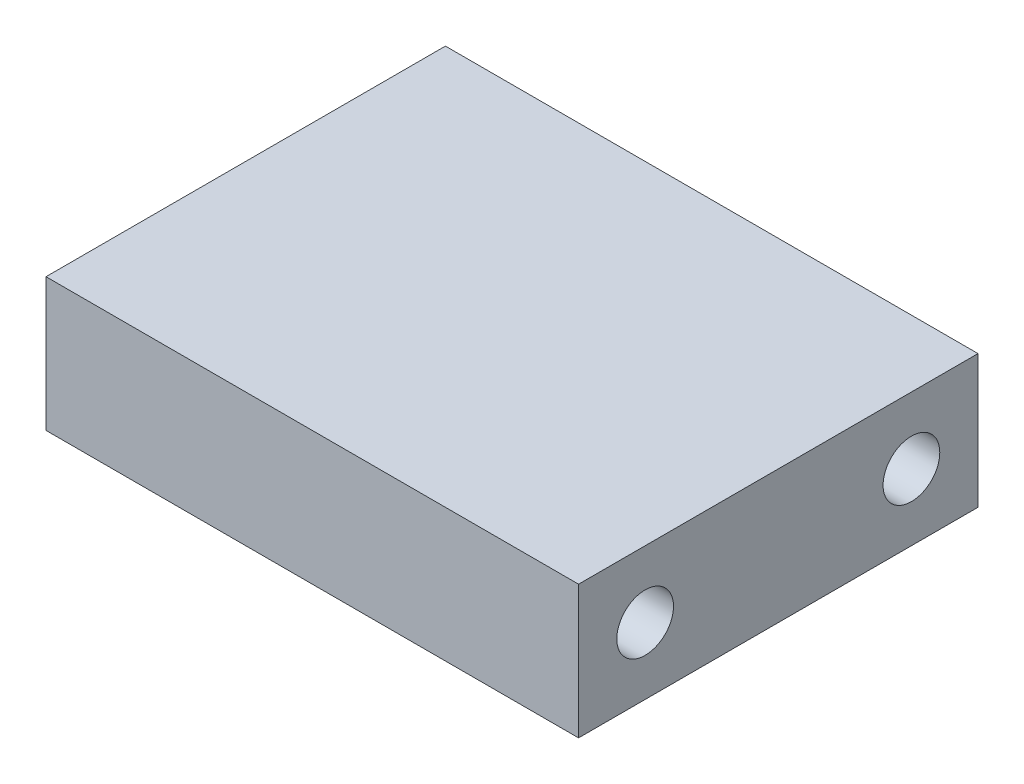
ISO-10303-21;
HEADER;
FILE_DESCRIPTION(('STEP AP214'),'2;1');
FILE_NAME('part.step','',(''),(''),'','','');
FILE_SCHEMA(('AUTOMOTIVE_DESIGN { 1 0 10303 214 1 1 1 1 }'));
ENDSEC;
DATA;
#1=APPLICATION_CONTEXT('core data for automotive mechanical design processes');
#2=APPLICATION_PROTOCOL_DEFINITION('international standard','automotive_design',2000,#1);
#3=PRODUCT_CONTEXT('',#1,'mechanical');
#4=PRODUCT('Part','Part','',(#3));
#5=PRODUCT_RELATED_PRODUCT_CATEGORY('part','',(#4));
#6=PRODUCT_DEFINITION_FORMATION('','',#4);
#7=PRODUCT_DEFINITION_CONTEXT('part definition',#1,'design');
#8=PRODUCT_DEFINITION('design','',#6,#7);
#9=PRODUCT_DEFINITION_SHAPE('','',#8);
#10=(LENGTH_UNIT() NAMED_UNIT(*) SI_UNIT(.MILLI.,.METRE.));
#11=(NAMED_UNIT(*) PLANE_ANGLE_UNIT() SI_UNIT($,.RADIAN.));
#12=(NAMED_UNIT(*) SI_UNIT($,.STERADIAN.) SOLID_ANGLE_UNIT());
#13=UNCERTAINTY_MEASURE_WITH_UNIT(LENGTH_MEASURE(1.E-05),#10,'distance_accuracy_value','');
#14=(GEOMETRIC_REPRESENTATION_CONTEXT(3) GLOBAL_UNCERTAINTY_ASSIGNED_CONTEXT((#13)) GLOBAL_UNIT_ASSIGNED_CONTEXT((#10,
#11,#12)) REPRESENTATION_CONTEXT('',''));
#15=CARTESIAN_POINT('',(0.,0.,0.));
#16=DIRECTION('',(0.,0.,1.));
#17=DIRECTION('',(1.,0.,0.));
#18=AXIS2_PLACEMENT_3D('',#15,#16,#17);
#19=CARTESIAN_POINT('',(-12.7,6.35,-9.525));
#20=DIRECTION('',(1.,0.,0.));
#21=DIRECTION('',(0.,0.,-1.));
#22=AXIS2_PLACEMENT_3D('',#19,#20,#21);
#23=PLANE('',#22);
#24=DIRECTION('',(0.,0.,1.));
#25=VECTOR('',#24,1.);
#26=CARTESIAN_POINT('',(-12.7,0.,-9.525));
#27=LINE('',#26,#25);
#28=CARTESIAN_POINT('',(-12.7,0.,-9.525));
#29=VERTEX_POINT('',#28);
#30=CARTESIAN_POINT('',(-12.7,0.,9.525));
#31=VERTEX_POINT('',#30);
#32=EDGE_CURVE('E98',#29,#31,#27,.T.);
#33=ORIENTED_EDGE('',*,*,#32,.T.);
#34=DIRECTION('',(0.,-1.,0.));
#35=VECTOR('',#34,1.);
#36=CARTESIAN_POINT('',(-12.7,6.35,9.525));
#37=LINE('',#36,#35);
#38=CARTESIAN_POINT('',(-12.7,6.35,9.525));
#39=VERTEX_POINT('',#38);
#40=EDGE_CURVE('E11',#39,#31,#37,.T.);
#41=ORIENTED_EDGE('',*,*,#40,.F.);
#42=DIRECTION('',(0.,0.,1.));
#43=VECTOR('',#42,1.);
#44=CARTESIAN_POINT('',(-12.7,6.35,-9.525));
#45=LINE('',#44,#43);
#46=CARTESIAN_POINT('',(-12.7,6.35,-9.525));
#47=VERTEX_POINT('',#46);
#48=EDGE_CURVE('E107',#47,#39,#45,.T.);
#49=ORIENTED_EDGE('',*,*,#48,.F.);
#50=DIRECTION('',(0.,-1.,0.));
#51=VECTOR('',#50,1.);
#52=CARTESIAN_POINT('',(-12.7,6.35,-9.525));
#53=LINE('',#52,#51);
#54=EDGE_CURVE('E113',#47,#29,#53,.T.);
#55=ORIENTED_EDGE('',*,*,#54,.T.);
#56=EDGE_LOOP('',(#33,#41,#49,#55));
#57=FACE_BOUND('',#56,.T.);
#58=ADVANCED_FACE('F34',(#57),#23,.F.);
#59=CARTESIAN_POINT('',(-12.7,6.35,9.525));
#60=DIRECTION('',(0.,0.,-1.));
#61=DIRECTION('',(-1.,0.,0.));
#62=AXIS2_PLACEMENT_3D('',#59,#60,#61);
#63=PLANE('',#62);
#64=DIRECTION('',(1.,0.,0.));
#65=VECTOR('',#64,1.);
#66=CARTESIAN_POINT('',(-12.7,0.,9.525));
#67=LINE('',#66,#65);
#68=CARTESIAN_POINT('',(12.7,0.,9.525));
#69=VERTEX_POINT('',#68);
#70=EDGE_CURVE('E101',#31,#69,#67,.T.);
#71=ORIENTED_EDGE('',*,*,#70,.T.);
#72=DIRECTION('',(0.,-1.,0.));
#73=VECTOR('',#72,1.);
#74=CARTESIAN_POINT('',(12.7,6.35,9.525));
#75=LINE('',#74,#73);
#76=CARTESIAN_POINT('',(12.7,6.35,9.525));
#77=VERTEX_POINT('',#76);
#78=EDGE_CURVE('E41',#77,#69,#75,.T.);
#79=ORIENTED_EDGE('',*,*,#78,.F.);
#80=DIRECTION('',(1.,0.,0.));
#81=VECTOR('',#80,1.);
#82=CARTESIAN_POINT('',(-12.7,6.35,9.525));
#83=LINE('',#82,#81);
#84=EDGE_CURVE('E109',#39,#77,#83,.T.);
#85=ORIENTED_EDGE('',*,*,#84,.F.);
#86=ORIENTED_EDGE('',*,*,#40,.T.);
#87=EDGE_LOOP('',(#71,#79,#85,#86));
#88=FACE_BOUND('',#87,.T.);
#89=ADVANCED_FACE('F134',(#88),#63,.F.);
#90=CARTESIAN_POINT('',(12.7,6.35,-9.525));
#91=DIRECTION('',(-1.,0.,0.));
#92=DIRECTION('',(0.,0.,1.));
#93=AXIS2_PLACEMENT_3D('',#90,#91,#92);
#94=PLANE('',#93);
#95=CARTESIAN_POINT('',(12.7,3.175,6.35));
#96=DIRECTION('',(1.,0.,0.));
#97=DIRECTION('',(0.,0.,-1.));
#98=AXIS2_PLACEMENT_3D('',#95,#96,#97);
#99=CIRCLE('',#98,1.35255);
#100=CARTESIAN_POINT('',(12.7,3.175,4.99745));
#101=VERTEX_POINT('',#100);
#102=EDGE_CURVE('E87',#101,#101,#99,.T.);
#103=ORIENTED_EDGE('',*,*,#102,.F.);
#104=EDGE_LOOP('',(#103));
#105=FACE_BOUND('',#104,.T.);
#106=CARTESIAN_POINT('',(12.7,3.175,-6.35));
#107=DIRECTION('',(1.,0.,0.));
#108=DIRECTION('',(0.,0.,-1.));
#109=AXIS2_PLACEMENT_3D('',#106,#107,#108);
#110=CIRCLE('',#109,1.35255);
#111=CARTESIAN_POINT('',(12.7,3.175,-7.70255));
#112=VERTEX_POINT('',#111);
#113=EDGE_CURVE('E95',#112,#112,#110,.T.);
#114=ORIENTED_EDGE('',*,*,#113,.F.);
#115=EDGE_LOOP('',(#114));
#116=FACE_BOUND('',#115,.T.);
#117=DIRECTION('',(0.,0.,-1.));
#118=VECTOR('',#117,1.);
#119=CARTESIAN_POINT('',(12.7,0.,-9.525));
#120=LINE('',#119,#118);
#121=CARTESIAN_POINT('',(12.7,0.,-9.525));
#122=VERTEX_POINT('',#121);
#123=EDGE_CURVE('E103',#69,#122,#120,.T.);
#124=ORIENTED_EDGE('',*,*,#123,.T.);
#125=DIRECTION('',(0.,-1.,0.));
#126=VECTOR('',#125,1.);
#127=CARTESIAN_POINT('',(12.7,6.35,-9.525));
#128=LINE('',#127,#126);
#129=CARTESIAN_POINT('',(12.7,6.35,-9.525));
#130=VERTEX_POINT('',#129);
#131=EDGE_CURVE('E116',#130,#122,#128,.T.);
#132=ORIENTED_EDGE('',*,*,#131,.F.);
#133=DIRECTION('',(0.,0.,-1.));
#134=VECTOR('',#133,1.);
#135=CARTESIAN_POINT('',(12.7,6.35,-9.525));
#136=LINE('',#135,#134);
#137=EDGE_CURVE('E53',#77,#130,#136,.T.);
#138=ORIENTED_EDGE('',*,*,#137,.F.);
#139=ORIENTED_EDGE('',*,*,#78,.T.);
#140=EDGE_LOOP('',(#124,#132,#138,#139));
#141=FACE_BOUND('',#140,.T.);
#142=ADVANCED_FACE('F122',(#105,#116,#141),#94,.F.);
#143=CARTESIAN_POINT('',(-12.7,6.35,-9.525));
#144=DIRECTION('',(0.,0.,1.));
#145=DIRECTION('',(1.,0.,0.));
#146=AXIS2_PLACEMENT_3D('',#143,#144,#145);
#147=PLANE('',#146);
#148=DIRECTION('',(-1.,0.,0.));
#149=VECTOR('',#148,1.);
#150=CARTESIAN_POINT('',(-12.7,0.,-9.525));
#151=LINE('',#150,#149);
#152=EDGE_CURVE('E105',#122,#29,#151,.T.);
#153=ORIENTED_EDGE('',*,*,#152,.T.);
#154=ORIENTED_EDGE('',*,*,#54,.F.);
#155=DIRECTION('',(-1.,0.,0.));
#156=VECTOR('',#155,1.);
#157=CARTESIAN_POINT('',(-12.7,6.35,-9.525));
#158=LINE('',#157,#156);
#159=EDGE_CURVE('E48',#130,#47,#158,.T.);
#160=ORIENTED_EDGE('',*,*,#159,.F.);
#161=ORIENTED_EDGE('',*,*,#131,.T.);
#162=EDGE_LOOP('',(#153,#154,#160,#161));
#163=FACE_BOUND('',#162,.T.);
#164=ADVANCED_FACE('F129',(#163),#147,.F.);
#165=CARTESIAN_POINT('',(-12.7,6.35,9.525));
#166=DIRECTION('',(0.,1.,0.));
#167=DIRECTION('',(0.,0.,1.));
#168=AXIS2_PLACEMENT_3D('',#165,#166,#167);
#169=PLANE('',#168);
#170=ORIENTED_EDGE('',*,*,#48,.T.);
#171=ORIENTED_EDGE('',*,*,#84,.T.);
#172=ORIENTED_EDGE('',*,*,#137,.T.);
#173=ORIENTED_EDGE('',*,*,#159,.T.);
#174=EDGE_LOOP('',(#170,#171,#172,#173));
#175=FACE_BOUND('',#174,.T.);
#176=ADVANCED_FACE('F133',(#175),#169,.T.);
#177=CARTESIAN_POINT('',(-12.7,0.,9.525));
#178=DIRECTION('',(0.,1.,0.));
#179=DIRECTION('',(0.,0.,1.));
#180=AXIS2_PLACEMENT_3D('',#177,#178,#179);
#181=PLANE('',#180);
#182=ORIENTED_EDGE('',*,*,#32,.F.);
#183=ORIENTED_EDGE('',*,*,#152,.F.);
#184=ORIENTED_EDGE('',*,*,#123,.F.);
#185=ORIENTED_EDGE('',*,*,#70,.F.);
#186=EDGE_LOOP('',(#182,#183,#184,#185));
#187=FACE_BOUND('',#186,.T.);
#188=ADVANCED_FACE('F127',(#187),#181,.F.);
#189=CARTESIAN_POINT('',(12.7,3.175,-6.35));
#190=DIRECTION('',(1.,0.,0.));
#191=DIRECTION('',(0.,0.,-1.));
#192=AXIS2_PLACEMENT_3D('',#189,#190,#191);
#193=CYLINDRICAL_SURFACE('',#192,1.35255);
#194=CARTESIAN_POINT('',(0.,3.175,-6.35));
#195=DIRECTION('',(1.,0.,0.));
#196=DIRECTION('',(0.,0.,-1.));
#197=AXIS2_PLACEMENT_3D('',#194,#195,#196);
#198=CIRCLE('',#197,1.35255);
#199=CARTESIAN_POINT('',(0.,3.175,-7.70255));
#200=VERTEX_POINT('',#199);
#201=EDGE_CURVE('E90',#200,#200,#198,.T.);
#202=ORIENTED_EDGE('',*,*,#201,.F.);
#203=EDGE_LOOP('',(#202));
#204=FACE_BOUND('',#203,.T.);
#205=ORIENTED_EDGE('',*,*,#113,.T.);
#206=EDGE_LOOP('',(#205));
#207=FACE_BOUND('',#206,.T.);
#208=ADVANCED_FACE('F149',(#204,#207),#193,.F.);
#209=CARTESIAN_POINT('',(0.,3.175,-6.35));
#210=DIRECTION('',(1.,0.,0.));
#211=DIRECTION('',(0.,0.,-1.));
#212=AXIS2_PLACEMENT_3D('',#209,#210,#211);
#213=CONICAL_SURFACE('',#212,1.35255,1.02974425867665);
#214=CARTESIAN_POINT('',(-0.812694030265727,3.175,-6.35));
#215=VERTEX_POINT('',#214);
#216=VERTEX_LOOP('',#215);
#217=FACE_BOUND('',#216,.T.);
#218=ORIENTED_EDGE('',*,*,#201,.T.);
#219=EDGE_LOOP('',(#218));
#220=FACE_BOUND('',#219,.T.);
#221=ADVANCED_FACE('F152',(#217,#220),#213,.F.);
#222=CARTESIAN_POINT('',(12.7,3.175,6.35));
#223=DIRECTION('',(1.,0.,0.));
#224=DIRECTION('',(0.,0.,-1.));
#225=AXIS2_PLACEMENT_3D('',#222,#223,#224);
#226=CYLINDRICAL_SURFACE('',#225,1.35255);
#227=CARTESIAN_POINT('',(0.,3.175,6.35));
#228=DIRECTION('',(1.,0.,0.));
#229=DIRECTION('',(0.,0.,-1.));
#230=AXIS2_PLACEMENT_3D('',#227,#228,#229);
#231=CIRCLE('',#230,1.35255);
#232=CARTESIAN_POINT('',(0.,3.175,4.99745));
#233=VERTEX_POINT('',#232);
#234=EDGE_CURVE('E85',#233,#233,#231,.T.);
#235=ORIENTED_EDGE('',*,*,#234,.F.);
#236=EDGE_LOOP('',(#235));
#237=FACE_BOUND('',#236,.T.);
#238=ORIENTED_EDGE('',*,*,#102,.T.);
#239=EDGE_LOOP('',(#238));
#240=FACE_BOUND('',#239,.T.);
#241=ADVANCED_FACE('F81',(#237,#240),#226,.F.);
#242=CARTESIAN_POINT('',(0.,3.175,6.35));
#243=DIRECTION('',(1.,0.,0.));
#244=DIRECTION('',(0.,0.,-1.));
#245=AXIS2_PLACEMENT_3D('',#242,#243,#244);
#246=CONICAL_SURFACE('',#245,1.35255,1.02974425867665);
#247=CARTESIAN_POINT('',(-0.812694030265727,3.175,6.35));
#248=VERTEX_POINT('',#247);
#249=VERTEX_LOOP('',#248);
#250=FACE_BOUND('',#249,.T.);
#251=ORIENTED_EDGE('',*,*,#234,.T.);
#252=EDGE_LOOP('',(#251));
#253=FACE_BOUND('',#252,.T.);
#254=ADVANCED_FACE('F78',(#250,#253),#246,.F.);
#255=CLOSED_SHELL('',(#58,#89,#142,#164,#176,#188,#208,#221,#241,#254));
#256=MANIFOLD_SOLID_BREP('B2',#255);
#257=ADVANCED_BREP_SHAPE_REPRESENTATION('',(#18,#256),#14);
#258=SHAPE_DEFINITION_REPRESENTATION(#9,#257);
ENDSEC;
END-ISO-10303-21;
